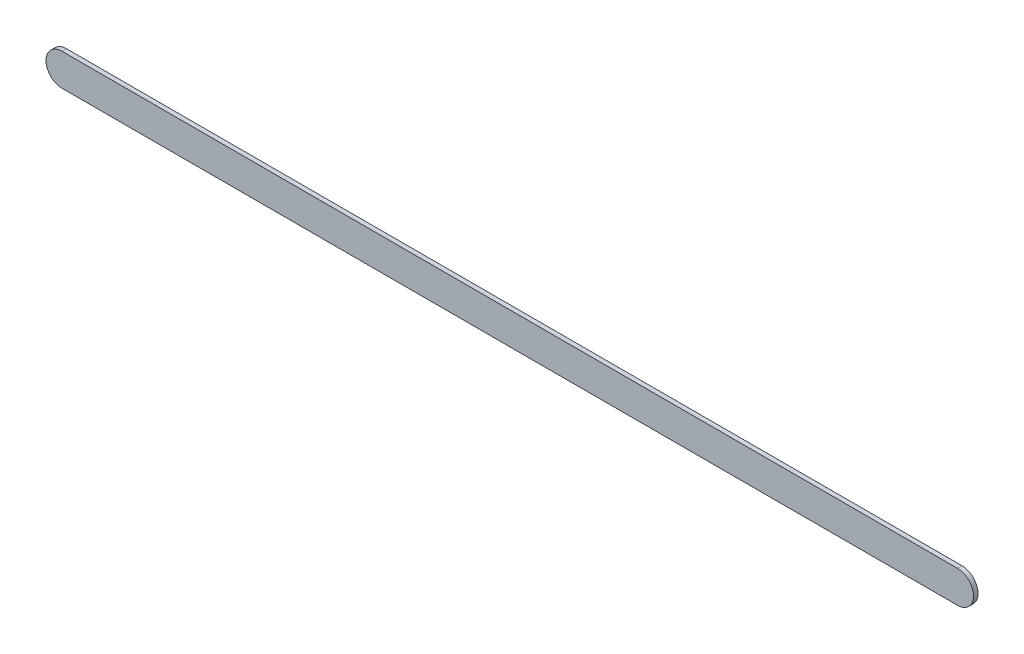
ISO-10303-21;
HEADER;
FILE_DESCRIPTION(('STEP AP214'),'2;1');
FILE_NAME('part.step','',(''),(''),'','','');
FILE_SCHEMA(('AUTOMOTIVE_DESIGN { 1 0 10303 214 1 1 1 1 }'));
ENDSEC;
DATA;
#1=APPLICATION_CONTEXT('core data for automotive mechanical design processes');
#2=APPLICATION_PROTOCOL_DEFINITION('international standard','automotive_design',2000,#1);
#3=PRODUCT_CONTEXT('',#1,'mechanical');
#4=PRODUCT('Part','Part','',(#3));
#5=PRODUCT_RELATED_PRODUCT_CATEGORY('part','',(#4));
#6=PRODUCT_DEFINITION_FORMATION('','',#4);
#7=PRODUCT_DEFINITION_CONTEXT('part definition',#1,'design');
#8=PRODUCT_DEFINITION('design','',#6,#7);
#9=PRODUCT_DEFINITION_SHAPE('','',#8);
#10=(LENGTH_UNIT() NAMED_UNIT(*) SI_UNIT(.MILLI.,.METRE.));
#11=(NAMED_UNIT(*) PLANE_ANGLE_UNIT() SI_UNIT($,.RADIAN.));
#12=(NAMED_UNIT(*) SI_UNIT($,.STERADIAN.) SOLID_ANGLE_UNIT());
#13=UNCERTAINTY_MEASURE_WITH_UNIT(LENGTH_MEASURE(1.E-05),#10,'distance_accuracy_value','');
#14=(GEOMETRIC_REPRESENTATION_CONTEXT(3) GLOBAL_UNCERTAINTY_ASSIGNED_CONTEXT((#13)) GLOBAL_UNIT_ASSIGNED_CONTEXT((#10,
#11,#12)) REPRESENTATION_CONTEXT('',''));
#15=CARTESIAN_POINT('',(0.,0.,0.));
#16=DIRECTION('',(0.,0.,1.));
#17=DIRECTION('',(1.,0.,0.));
#18=AXIS2_PLACEMENT_3D('',#15,#16,#17);
#19=CARTESIAN_POINT('',(91.1169755,96.75997158,0.));
#20=DIRECTION('',(0.,1.,0.));
#21=DIRECTION('',(1.,0.,0.));
#22=AXIS2_PLACEMENT_3D('',#19,#20,#21);
#23=PLANE('',#22);
#24=DIRECTION('',(1.,0.,0.));
#25=VECTOR('',#24,1.);
#26=CARTESIAN_POINT('',(91.1169755,96.75997158,0.03556));
#27=LINE('',#26,#25);
#28=CARTESIAN_POINT('',(91.1169755,96.75997158,0.03556));
#29=VERTEX_POINT('',#28);
#30=CARTESIAN_POINT('',(98.216974,96.75997158,0.03556));
#31=VERTEX_POINT('',#30);
#32=EDGE_CURVE('E11',#29,#31,#27,.T.);
#33=ORIENTED_EDGE('',*,*,#32,.F.);
#34=DIRECTION('',(0.,0.,1.));
#35=VECTOR('',#34,1.);
#36=CARTESIAN_POINT('',(91.1169755,96.75997158,0.));
#37=LINE('',#36,#35);
#38=CARTESIAN_POINT('',(91.1169755,96.75997158,0.));
#39=VERTEX_POINT('',#38);
#40=EDGE_CURVE('E24',#39,#29,#37,.T.);
#41=ORIENTED_EDGE('',*,*,#40,.F.);
#42=DIRECTION('',(1.,0.,0.));
#43=VECTOR('',#42,1.);
#44=CARTESIAN_POINT('',(91.1169755,96.75997158,0.));
#45=LINE('',#44,#43);
#46=CARTESIAN_POINT('',(98.216974,96.75997158,0.));
#47=VERTEX_POINT('',#46);
#48=EDGE_CURVE('E75',#39,#47,#45,.T.);
#49=ORIENTED_EDGE('',*,*,#48,.T.);
#50=DIRECTION('',(0.,0.,1.));
#51=VECTOR('',#50,1.);
#52=CARTESIAN_POINT('',(98.216974,96.75997158,0.));
#53=LINE('',#52,#51);
#54=EDGE_CURVE('E37',#47,#31,#53,.T.);
#55=ORIENTED_EDGE('',*,*,#54,.T.);
#56=EDGE_LOOP('',(#33,#41,#49,#55));
#57=FACE_BOUND('',#56,.T.);
#58=ADVANCED_FACE('F17',(#57),#23,.F.);
#59=CARTESIAN_POINT('',(98.216974,96.88697158,0.));
#60=DIRECTION('',(0.,0.,-1.));
#61=DIRECTION('',(0.,-1.,0.));
#62=AXIS2_PLACEMENT_3D('',#59,#60,#61);
#63=CYLINDRICAL_SURFACE('',#62,0.127000000000005);
#64=CARTESIAN_POINT('',(98.216974,96.88697158,0.03556));
#65=DIRECTION('',(0.,0.,1.));
#66=DIRECTION('',(0.,-1.,0.));
#67=AXIS2_PLACEMENT_3D('',#64,#65,#66);
#68=CIRCLE('',#67,0.127000000000005);
#69=CARTESIAN_POINT('',(98.216974,97.01397158,0.03556));
#70=VERTEX_POINT('',#69);
#71=EDGE_CURVE('E83',#31,#70,#68,.T.);
#72=ORIENTED_EDGE('',*,*,#71,.F.);
#73=ORIENTED_EDGE('',*,*,#54,.F.);
#74=CARTESIAN_POINT('',(98.216974,96.88697158,0.));
#75=DIRECTION('',(0.,0.,1.));
#76=DIRECTION('',(0.,-1.,0.));
#77=AXIS2_PLACEMENT_3D('',#74,#75,#76);
#78=CIRCLE('',#77,0.127000000000005);
#79=CARTESIAN_POINT('',(98.216974,97.01397158,0.));
#80=VERTEX_POINT('',#79);
#81=EDGE_CURVE('E81',#47,#80,#78,.T.);
#82=ORIENTED_EDGE('',*,*,#81,.T.);
#83=DIRECTION('',(0.,0.,1.));
#84=VECTOR('',#83,1.);
#85=CARTESIAN_POINT('',(98.216974,97.01397158,0.));
#86=LINE('',#85,#84);
#87=EDGE_CURVE('E67',#80,#70,#86,.T.);
#88=ORIENTED_EDGE('',*,*,#87,.T.);
#89=EDGE_LOOP('',(#72,#73,#82,#88));
#90=FACE_BOUND('',#89,.T.);
#91=ADVANCED_FACE('F89',(#90),#63,.T.);
#92=CARTESIAN_POINT('',(98.216974,97.01397158,0.));
#93=DIRECTION('',(0.,-1.,0.));
#94=DIRECTION('',(-1.,0.,0.));
#95=AXIS2_PLACEMENT_3D('',#92,#93,#94);
#96=PLANE('',#95);
#97=DIRECTION('',(-1.,0.,0.));
#98=VECTOR('',#97,1.);
#99=CARTESIAN_POINT('',(98.216974,97.01397158,0.03556));
#100=LINE('',#99,#98);
#101=CARTESIAN_POINT('',(91.1169755,97.01397158,0.03556));
#102=VERTEX_POINT('',#101);
#103=EDGE_CURVE('E71',#70,#102,#100,.T.);
#104=ORIENTED_EDGE('',*,*,#103,.F.);
#105=ORIENTED_EDGE('',*,*,#87,.F.);
#106=DIRECTION('',(-1.,0.,0.));
#107=VECTOR('',#106,1.);
#108=CARTESIAN_POINT('',(98.216974,97.01397158,0.));
#109=LINE('',#108,#107);
#110=CARTESIAN_POINT('',(91.1169755,97.01397158,0.));
#111=VERTEX_POINT('',#110);
#112=EDGE_CURVE('E63',#80,#111,#109,.T.);
#113=ORIENTED_EDGE('',*,*,#112,.T.);
#114=DIRECTION('',(0.,0.,1.));
#115=VECTOR('',#114,1.);
#116=CARTESIAN_POINT('',(91.1169755,97.01397158,0.));
#117=LINE('',#116,#115);
#118=EDGE_CURVE('E53',#111,#102,#117,.T.);
#119=ORIENTED_EDGE('',*,*,#118,.T.);
#120=EDGE_LOOP('',(#104,#105,#113,#119));
#121=FACE_BOUND('',#120,.T.);
#122=ADVANCED_FACE('F66',(#121),#96,.F.);
#123=CARTESIAN_POINT('',(91.1169755,96.88697158,0.));
#124=DIRECTION('',(0.,0.,-1.));
#125=DIRECTION('',(0.,1.,0.));
#126=AXIS2_PLACEMENT_3D('',#123,#124,#125);
#127=CYLINDRICAL_SURFACE('',#126,0.127);
#128=CARTESIAN_POINT('',(91.1169755,96.88697158,0.03556));
#129=DIRECTION('',(0.,0.,1.));
#130=DIRECTION('',(0.,1.,0.));
#131=AXIS2_PLACEMENT_3D('',#128,#129,#130);
#132=CIRCLE('',#131,0.127);
#133=EDGE_CURVE('E59',#102,#29,#132,.T.);
#134=ORIENTED_EDGE('',*,*,#133,.F.);
#135=ORIENTED_EDGE('',*,*,#118,.F.);
#136=CARTESIAN_POINT('',(91.1169755,96.88697158,0.));
#137=DIRECTION('',(0.,0.,1.));
#138=DIRECTION('',(0.,1.,0.));
#139=AXIS2_PLACEMENT_3D('',#136,#137,#138);
#140=CIRCLE('',#139,0.127);
#141=EDGE_CURVE('E57',#111,#39,#140,.T.);
#142=ORIENTED_EDGE('',*,*,#141,.T.);
#143=ORIENTED_EDGE('',*,*,#40,.T.);
#144=EDGE_LOOP('',(#134,#135,#142,#143));
#145=FACE_BOUND('',#144,.T.);
#146=ADVANCED_FACE('F55',(#145),#127,.T.);
#147=CARTESIAN_POINT('',(91.1169755,96.75997158,0.));
#148=DIRECTION('',(0.,0.,-1.));
#149=DIRECTION('',(-1.,0.,0.));
#150=AXIS2_PLACEMENT_3D('',#147,#148,#149);
#151=PLANE('',#150);
#152=ORIENTED_EDGE('',*,*,#141,.F.);
#153=ORIENTED_EDGE('',*,*,#112,.F.);
#154=ORIENTED_EDGE('',*,*,#81,.F.);
#155=ORIENTED_EDGE('',*,*,#48,.F.);
#156=EDGE_LOOP('',(#152,#153,#154,#155));
#157=FACE_BOUND('',#156,.T.);
#158=ADVANCED_FACE('F74',(#157),#151,.T.);
#159=CARTESIAN_POINT('',(91.1169755,96.75997158,0.03556));
#160=DIRECTION('',(0.,0.,-1.));
#161=DIRECTION('',(-1.,0.,0.));
#162=AXIS2_PLACEMENT_3D('',#159,#160,#161);
#163=PLANE('',#162);
#164=ORIENTED_EDGE('',*,*,#32,.T.);
#165=ORIENTED_EDGE('',*,*,#71,.T.);
#166=ORIENTED_EDGE('',*,*,#103,.T.);
#167=ORIENTED_EDGE('',*,*,#133,.T.);
#168=EDGE_LOOP('',(#164,#165,#166,#167));
#169=FACE_BOUND('',#168,.T.);
#170=ADVANCED_FACE('F91',(#169),#163,.F.);
#171=CLOSED_SHELL('',(#58,#91,#122,#146,#158,#170));
#172=MANIFOLD_SOLID_BREP('B1',#171);
#173=ADVANCED_BREP_SHAPE_REPRESENTATION('',(#18,#172),#14);
#174=SHAPE_DEFINITION_REPRESENTATION(#9,#173);
ENDSEC;
END-ISO-10303-21;
